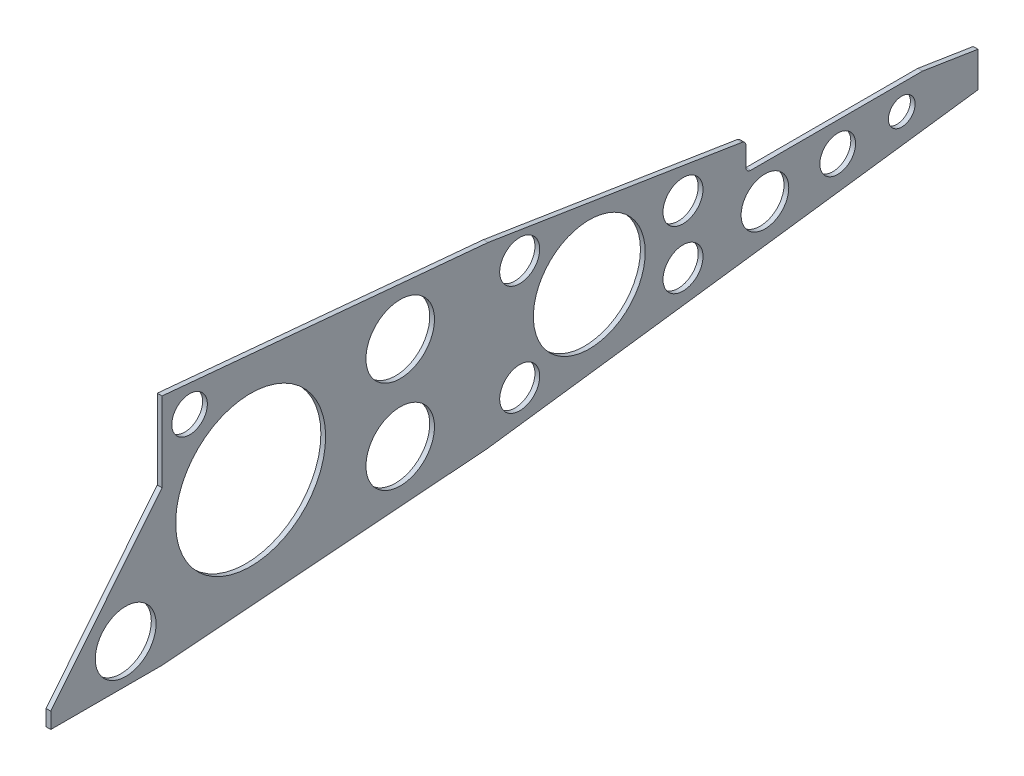
ISO-10303-21;
HEADER;
FILE_DESCRIPTION(('STEP AP214'),'2;1');
FILE_NAME('part.step','',(''),(''),'','','');
FILE_SCHEMA(('AUTOMOTIVE_DESIGN { 1 0 10303 214 1 1 1 1 }'));
ENDSEC;
DATA;
#1=APPLICATION_CONTEXT('core data for automotive mechanical design processes');
#2=APPLICATION_PROTOCOL_DEFINITION('international standard','automotive_design',2000,#1);
#3=PRODUCT_CONTEXT('',#1,'mechanical');
#4=PRODUCT('Part','Part','',(#3));
#5=PRODUCT_RELATED_PRODUCT_CATEGORY('part','',(#4));
#6=PRODUCT_DEFINITION_FORMATION('','',#4);
#7=PRODUCT_DEFINITION_CONTEXT('part definition',#1,'design');
#8=PRODUCT_DEFINITION('design','',#6,#7);
#9=PRODUCT_DEFINITION_SHAPE('','',#8);
#10=(LENGTH_UNIT() NAMED_UNIT(*) SI_UNIT(.MILLI.,.METRE.));
#11=(NAMED_UNIT(*) PLANE_ANGLE_UNIT() SI_UNIT($,.RADIAN.));
#12=(NAMED_UNIT(*) SI_UNIT($,.STERADIAN.) SOLID_ANGLE_UNIT());
#13=UNCERTAINTY_MEASURE_WITH_UNIT(LENGTH_MEASURE(1.E-05),#10,'distance_accuracy_value','');
#14=(GEOMETRIC_REPRESENTATION_CONTEXT(3) GLOBAL_UNCERTAINTY_ASSIGNED_CONTEXT((#13)) GLOBAL_UNIT_ASSIGNED_CONTEXT((#10,
#11,#12)) REPRESENTATION_CONTEXT('',''));
#15=CARTESIAN_POINT('',(0.,0.,0.));
#16=DIRECTION('',(0.,0.,1.));
#17=DIRECTION('',(1.,0.,0.));
#18=AXIS2_PLACEMENT_3D('',#15,#16,#17);
#19=CARTESIAN_POINT('',(-1.5,48.288859026105,-205.165503831176));
#20=DIRECTION('',(0.,0.987688340595138,-0.156434465040231));
#21=DIRECTION('',(0.,0.156434465040231,0.987688340595138));
#22=AXIS2_PLACEMENT_3D('',#19,#20,#21);
#23=PLANE('',#22);
#24=DIRECTION('',(-1.,0.,0.));
#25=VECTOR('',#24,1.);
#26=CARTESIAN_POINT('',(-1.5,5.,-478.480603075801));
#27=LINE('',#26,#25);
#28=CARTESIAN_POINT('',(1.5,5.,-478.4806030758));
#29=VERTEX_POINT('',#28);
#30=CARTESIAN_POINT('',(-1.5,5.,-478.4806030758));
#31=VERTEX_POINT('',#30);
#32=EDGE_CURVE('E149',#29,#31,#27,.T.);
#33=ORIENTED_EDGE('',*,*,#32,.F.);
#34=DIRECTION('',(0.,0.156434465040231,0.987688340595138));
#35=VECTOR('',#34,1.);
#36=CARTESIAN_POINT('',(1.5,48.288859026105,-205.165503831176));
#37=LINE('',#36,#35);
#38=CARTESIAN_POINT('',(1.5,-0.530689138309698,-513.4));
#39=VERTEX_POINT('',#38);
#40=EDGE_CURVE('E161',#39,#29,#37,.T.);
#41=ORIENTED_EDGE('',*,*,#40,.F.);
#42=DIRECTION('',(1.,0.,0.));
#43=VECTOR('',#42,1.);
#44=CARTESIAN_POINT('',(-1.5,-0.530689138309698,-513.4));
#45=LINE('',#44,#43);
#46=CARTESIAN_POINT('',(-1.5,-0.530689138309698,-513.4));
#47=VERTEX_POINT('',#46);
#48=EDGE_CURVE('E236',#47,#39,#45,.T.);
#49=ORIENTED_EDGE('',*,*,#48,.F.);
#50=DIRECTION('',(0.,0.156434465040231,0.987688340595138));
#51=VECTOR('',#50,1.);
#52=CARTESIAN_POINT('',(-1.5,48.288859026105,-205.165503831176));
#53=LINE('',#52,#51);
#54=EDGE_CURVE('E163',#47,#31,#53,.T.);
#55=ORIENTED_EDGE('',*,*,#54,.T.);
#56=EDGE_LOOP('',(#33,#41,#49,#55));
#57=FACE_BOUND('',#56,.T.);
#58=ADVANCED_FACE('F43',(#57),#23,.T.);
#59=CARTESIAN_POINT('',(-1.5,17.2248503298606,0.));
#60=DIRECTION('',(0.,0.627918395010104,0.778279184616892));
#61=DIRECTION('',(0.,-0.778279184616892,0.627918395010104));
#62=AXIS2_PLACEMENT_3D('',#59,#60,#61);
#63=PLANE('',#62);
#64=DIRECTION('',(1.,0.,0.));
#65=VECTOR('',#64,1.);
#66=CARTESIAN_POINT('',(-1.5,-69.5372884386745,70.));
#67=LINE('',#66,#65);
#68=CARTESIAN_POINT('',(-1.5,-69.5372884386745,70.));
#69=VERTEX_POINT('',#68);
#70=CARTESIAN_POINT('',(1.5,-69.5372884386745,70.));
#71=VERTEX_POINT('',#70);
#72=EDGE_CURVE('E224',#69,#71,#67,.T.);
#73=ORIENTED_EDGE('',*,*,#72,.T.);
#74=DIRECTION('',(0.,-0.778279184616892,0.627918395010104));
#75=VECTOR('',#74,1.);
#76=CARTESIAN_POINT('',(1.5,17.2248503298606,0.));
#77=LINE('',#76,#75);
#78=CARTESIAN_POINT('',(1.5,17.2248503298606,0.));
#79=VERTEX_POINT('',#78);
#80=EDGE_CURVE('E165',#79,#71,#77,.T.);
#81=ORIENTED_EDGE('',*,*,#80,.F.);
#82=DIRECTION('',(1.,0.,0.));
#83=VECTOR('',#82,1.);
#84=CARTESIAN_POINT('',(-1.5,17.2248503298606,0.));
#85=LINE('',#84,#83);
#86=CARTESIAN_POINT('',(-1.5,17.2248503298606,0.));
#87=VERTEX_POINT('',#86);
#88=EDGE_CURVE('E225',#87,#79,#85,.T.);
#89=ORIENTED_EDGE('',*,*,#88,.F.);
#90=DIRECTION('',(0.,-0.778279184616892,0.627918395010104));
#91=VECTOR('',#90,1.);
#92=CARTESIAN_POINT('',(-1.5,17.2248503298606,0.));
#93=LINE('',#92,#91);
#94=EDGE_CURVE('E189',#87,#69,#93,.T.);
#95=ORIENTED_EDGE('',*,*,#94,.T.);
#96=EDGE_LOOP('',(#73,#81,#89,#95));
#97=FACE_BOUND('',#96,.T.);
#98=ADVANCED_FACE('F287',(#97),#63,.T.);
#99=CARTESIAN_POINT('',(-1.5,67.2248503298606,0.));
#100=DIRECTION('',(0.,0.,1.));
#101=DIRECTION('',(0.,-1.,0.));
#102=AXIS2_PLACEMENT_3D('',#99,#100,#101);
#103=PLANE('',#102);
#104=ORIENTED_EDGE('',*,*,#88,.T.);
#105=DIRECTION('',(0.,-1.,0.));
#106=VECTOR('',#105,1.);
#107=CARTESIAN_POINT('',(1.5,67.2248503298606,0.));
#108=LINE('',#107,#106);
#109=CARTESIAN_POINT('',(1.5,67.2248503298606,0.));
#110=VERTEX_POINT('',#109);
#111=EDGE_CURVE('E181',#110,#79,#108,.T.);
#112=ORIENTED_EDGE('',*,*,#111,.F.);
#113=DIRECTION('',(1.,0.,0.));
#114=VECTOR('',#113,1.);
#115=CARTESIAN_POINT('',(-1.5,67.2248503298606,0.));
#116=LINE('',#115,#114);
#117=CARTESIAN_POINT('',(-1.5,67.2248503298606,0.));
#118=VERTEX_POINT('',#117);
#119=EDGE_CURVE('E229',#118,#110,#116,.T.);
#120=ORIENTED_EDGE('',*,*,#119,.F.);
#121=DIRECTION('',(0.,-1.,0.));
#122=VECTOR('',#121,1.);
#123=CARTESIAN_POINT('',(-1.5,67.2248503298606,0.));
#124=LINE('',#123,#122);
#125=EDGE_CURVE('E220',#118,#87,#124,.T.);
#126=ORIENTED_EDGE('',*,*,#125,.T.);
#127=EDGE_LOOP('',(#104,#112,#120,#126));
#128=FACE_BOUND('',#127,.T.);
#129=ADVANCED_FACE('F293',(#128),#103,.T.);
#130=CARTESIAN_POINT('',(-1.5,67.2248503298606,0.));
#131=DIRECTION('',(0.,0.995767728619681,-0.0919055528224595));
#132=DIRECTION('',(0.,0.0919055528224595,0.995767728619681));
#133=AXIS2_PLACEMENT_3D('',#130,#131,#132);
#134=PLANE('',#133);
#135=ORIENTED_EDGE('',*,*,#119,.T.);
#136=DIRECTION('',(0.,0.0919055528224595,0.995767728619681));
#137=VECTOR('',#136,1.);
#138=CARTESIAN_POINT('',(1.5,67.2248503298606,0.));
#139=LINE('',#138,#137);
#140=CARTESIAN_POINT('',(1.5,48.288859026105,-205.165503831176));
#141=VERTEX_POINT('',#140);
#142=EDGE_CURVE('E175',#141,#110,#139,.T.);
#143=ORIENTED_EDGE('',*,*,#142,.F.);
#144=DIRECTION('',(1.,0.,0.));
#145=VECTOR('',#144,1.);
#146=CARTESIAN_POINT('',(-1.5,48.288859026105,-205.165503831176));
#147=LINE('',#146,#145);
#148=CARTESIAN_POINT('',(-1.5,48.288859026105,-205.165503831176));
#149=VERTEX_POINT('',#148);
#150=EDGE_CURVE('E232',#149,#141,#147,.T.);
#151=ORIENTED_EDGE('',*,*,#150,.F.);
#152=DIRECTION('',(0.,0.0919055528224595,0.995767728619681));
#153=VECTOR('',#152,1.);
#154=CARTESIAN_POINT('',(-1.5,67.2248503298606,0.));
#155=LINE('',#154,#153);
#156=EDGE_CURVE('E216',#149,#118,#155,.T.);
#157=ORIENTED_EDGE('',*,*,#156,.T.);
#158=EDGE_LOOP('',(#135,#143,#151,#157));
#159=FACE_BOUND('',#158,.T.);
#160=ADVANCED_FACE('F300',(#159),#134,.T.);
#161=CARTESIAN_POINT('',(1.5,22.9942621144677,-364.869303395121));
#162=VERTEX_POINT('',#161);
#163=EDGE_CURVE('E176',#162,#141,#37,.T.);
#164=ORIENTED_EDGE('',*,*,#163,.F.);
#165=DIRECTION('',(1.,0.,0.));
#166=VECTOR('',#165,1.);
#167=CARTESIAN_POINT('',(-1.5,22.9942621144677,-364.869303395121));
#168=LINE('',#167,#166);
#169=CARTESIAN_POINT('',(-1.5,22.9942621144677,-364.869303395121));
#170=VERTEX_POINT('',#169);
#171=EDGE_CURVE('E65',#162,#170,#168,.F.);
#172=ORIENTED_EDGE('',*,*,#171,.T.);
#173=EDGE_CURVE('E213',#170,#149,#53,.T.);
#174=ORIENTED_EDGE('',*,*,#173,.T.);
#175=ORIENTED_EDGE('',*,*,#150,.T.);
#176=EDGE_LOOP('',(#164,#172,#174,#175));
#177=FACE_BOUND('',#176,.T.);
#178=ADVANCED_FACE('F289',(#177),#23,.T.);
#179=CARTESIAN_POINT('',(-1.5,-0.530689138309698,-513.4));
#180=DIRECTION('',(0.,0.,-1.));
#181=DIRECTION('',(-1.,0.,0.));
#182=AXIS2_PLACEMENT_3D('',#179,#180,#181);
#183=PLANE('',#182);
#184=ORIENTED_EDGE('',*,*,#48,.T.);
#185=DIRECTION('',(0.,1.,0.));
#186=VECTOR('',#185,1.);
#187=CARTESIAN_POINT('',(1.5,-0.530689138309698,-513.4));
#188=LINE('',#187,#186);
#189=CARTESIAN_POINT('',(1.5,-22.6501543513627,-513.4));
#190=VERTEX_POINT('',#189);
#191=EDGE_CURVE('E173',#190,#39,#188,.T.);
#192=ORIENTED_EDGE('',*,*,#191,.F.);
#193=DIRECTION('',(1.,0.,0.));
#194=VECTOR('',#193,1.);
#195=CARTESIAN_POINT('',(-1.5,-22.6501543513627,-513.4));
#196=LINE('',#195,#194);
#197=CARTESIAN_POINT('',(-1.5,-22.6501543513627,-513.4));
#198=VERTEX_POINT('',#197);
#199=EDGE_CURVE('E239',#198,#190,#196,.T.);
#200=ORIENTED_EDGE('',*,*,#199,.F.);
#201=DIRECTION('',(0.,1.,0.));
#202=VECTOR('',#201,1.);
#203=CARTESIAN_POINT('',(-1.5,-0.530689138309698,-513.4));
#204=LINE('',#203,#202);
#205=EDGE_CURVE('E209',#198,#47,#204,.T.);
#206=ORIENTED_EDGE('',*,*,#205,.T.);
#207=EDGE_LOOP('',(#184,#192,#200,#206));
#208=FACE_BOUND('',#207,.T.);
#209=ADVANCED_FACE('F299',(#208),#183,.T.);
#210=CARTESIAN_POINT('',(-1.5,-22.6501543513627,-513.4));
#211=DIRECTION('',(0.,-0.991235972394931,-0.132103168131108));
#212=DIRECTION('',(0.,0.132103168131108,-0.991235972394931));
#213=AXIS2_PLACEMENT_3D('',#210,#211,#212);
#214=PLANE('',#213);
#215=ORIENTED_EDGE('',*,*,#199,.T.);
#216=DIRECTION('',(0.,0.132103168131108,-0.991235972394931));
#217=VECTOR('',#216,1.);
#218=CARTESIAN_POINT('',(1.5,-22.6501543513627,-513.4));
#219=LINE('',#218,#217);
#220=CARTESIAN_POINT('',(1.5,-63.7176077513932,-205.250409943522));
#221=VERTEX_POINT('',#220);
#222=EDGE_CURVE('E334',#221,#190,#219,.T.);
#223=ORIENTED_EDGE('',*,*,#222,.F.);
#224=DIRECTION('',(1.,0.,0.));
#225=VECTOR('',#224,1.);
#226=CARTESIAN_POINT('',(-1.5,-63.7176077513932,-205.250409943522));
#227=LINE('',#226,#225);
#228=CARTESIAN_POINT('',(-1.5,-63.7176077513932,-205.250409943522));
#229=VERTEX_POINT('',#228);
#230=EDGE_CURVE('E242',#229,#221,#227,.T.);
#231=ORIENTED_EDGE('',*,*,#230,.F.);
#232=DIRECTION('',(0.,0.132103168131108,-0.991235972394931));
#233=VECTOR('',#232,1.);
#234=CARTESIAN_POINT('',(-1.5,-22.6501543513627,-513.4));
#235=LINE('',#234,#233);
#236=EDGE_CURVE('E205',#229,#198,#235,.T.);
#237=ORIENTED_EDGE('',*,*,#236,.T.);
#238=EDGE_LOOP('',(#215,#223,#231,#237));
#239=FACE_BOUND('',#238,.T.);
#240=ADVANCED_FACE('F305',(#239),#214,.T.);
#241=CARTESIAN_POINT('',(-1.5,-63.7176077513932,-205.250409943522));
#242=DIRECTION('',(0.,-0.997042888850237,-0.0768471066024929));
#243=DIRECTION('',(0.,0.0768471066024929,-0.997042888850237));
#244=AXIS2_PLACEMENT_3D('',#241,#242,#243);
#245=PLANE('',#244);
#246=ORIENTED_EDGE('',*,*,#230,.T.);
#247=DIRECTION('',(0.,0.0768471066024929,-0.997042888850237));
#248=VECTOR('',#247,1.);
#249=CARTESIAN_POINT('',(1.5,-63.7176077513932,-205.250409943522));
#250=LINE('',#249,#248);
#251=CARTESIAN_POINT('',(1.5,-79.5372884386745,0.));
#252=VERTEX_POINT('',#251);
#253=EDGE_CURVE('E331',#252,#221,#250,.T.);
#254=ORIENTED_EDGE('',*,*,#253,.F.);
#255=DIRECTION('',(1.,0.,0.));
#256=VECTOR('',#255,1.);
#257=CARTESIAN_POINT('',(-1.5,-79.5372884386745,0.));
#258=LINE('',#257,#256);
#259=CARTESIAN_POINT('',(-1.5,-79.5372884386745,0.));
#260=VERTEX_POINT('',#259);
#261=EDGE_CURVE('E245',#260,#252,#258,.T.);
#262=ORIENTED_EDGE('',*,*,#261,.F.);
#263=DIRECTION('',(0.,0.0768471066024929,-0.997042888850237));
#264=VECTOR('',#263,1.);
#265=CARTESIAN_POINT('',(-1.5,-63.7176077513932,-205.250409943522));
#266=LINE('',#265,#264);
#267=EDGE_CURVE('E201',#260,#229,#266,.T.);
#268=ORIENTED_EDGE('',*,*,#267,.T.);
#269=EDGE_LOOP('',(#246,#254,#262,#268));
#270=FACE_BOUND('',#269,.T.);
#271=ADVANCED_FACE('F344',(#270),#245,.T.);
#272=CARTESIAN_POINT('',(-1.5,-79.5372884386745,70.));
#273=DIRECTION('',(0.,-1.,0.));
#274=DIRECTION('',(0.,0.,-1.));
#275=AXIS2_PLACEMENT_3D('',#272,#273,#274);
#276=PLANE('',#275);
#277=ORIENTED_EDGE('',*,*,#261,.T.);
#278=DIRECTION('',(0.,0.,-1.));
#279=VECTOR('',#278,1.);
#280=CARTESIAN_POINT('',(1.5,-79.5372884386745,70.));
#281=LINE('',#280,#279);
#282=CARTESIAN_POINT('',(1.5,-79.5372884386745,70.));
#283=VERTEX_POINT('',#282);
#284=EDGE_CURVE('E327',#283,#252,#281,.T.);
#285=ORIENTED_EDGE('',*,*,#284,.F.);
#286=DIRECTION('',(1.,0.,0.));
#287=VECTOR('',#286,1.);
#288=CARTESIAN_POINT('',(-1.5,-79.5372884386745,70.));
#289=LINE('',#288,#287);
#290=CARTESIAN_POINT('',(-1.5,-79.5372884386745,70.));
#291=VERTEX_POINT('',#290);
#292=EDGE_CURVE('E248',#291,#283,#289,.T.);
#293=ORIENTED_EDGE('',*,*,#292,.F.);
#294=DIRECTION('',(0.,0.,-1.));
#295=VECTOR('',#294,1.);
#296=CARTESIAN_POINT('',(-1.5,-79.5372884386745,70.));
#297=LINE('',#296,#295);
#298=EDGE_CURVE('E197',#291,#260,#297,.T.);
#299=ORIENTED_EDGE('',*,*,#298,.T.);
#300=EDGE_LOOP('',(#277,#285,#293,#299));
#301=FACE_BOUND('',#300,.T.);
#302=ADVANCED_FACE('F348',(#301),#276,.T.);
#303=CARTESIAN_POINT('',(-1.5,-69.5372884386745,70.));
#304=DIRECTION('',(0.,0.,1.));
#305=DIRECTION('',(1.,0.,0.));
#306=AXIS2_PLACEMENT_3D('',#303,#304,#305);
#307=PLANE('',#306);
#308=ORIENTED_EDGE('',*,*,#292,.T.);
#309=DIRECTION('',(0.,-1.,0.));
#310=VECTOR('',#309,1.);
#311=CARTESIAN_POINT('',(1.5,-69.5372884386745,70.));
#312=LINE('',#311,#310);
#313=EDGE_CURVE('E323',#71,#283,#312,.T.);
#314=ORIENTED_EDGE('',*,*,#313,.F.);
#315=ORIENTED_EDGE('',*,*,#72,.F.);
#316=DIRECTION('',(0.,-1.,0.));
#317=VECTOR('',#316,1.);
#318=CARTESIAN_POINT('',(-1.5,-69.5372884386745,70.));
#319=LINE('',#318,#317);
#320=EDGE_CURVE('E193',#69,#291,#319,.T.);
#321=ORIENTED_EDGE('',*,*,#320,.T.);
#322=EDGE_LOOP('',(#308,#314,#315,#321));
#323=FACE_BOUND('',#322,.T.);
#324=ADVANCED_FACE('F352',(#323),#307,.T.);
#325=CARTESIAN_POINT('',(-1.5,0.,0.));
#326=DIRECTION('',(1.,0.,0.));
#327=DIRECTION('',(0.,0.,-1.));
#328=AXIS2_PLACEMENT_3D('',#325,#326,#327);
#329=PLANE('',#328);
#330=CARTESIAN_POINT('',(-1.5,-55.0693391314664,22.8656003852971));
#331=DIRECTION('',(1.,0.,0.));
#332=DIRECTION('',(0.,0.,-1.));
#333=AXIS2_PLACEMENT_3D('',#330,#331,#332);
#334=CIRCLE('',#333,19.1193877962969);
#335=CARTESIAN_POINT('',(-1.5,-55.0693391314664,3.74621258900012));
#336=VERTEX_POINT('',#335);
#337=EDGE_CURVE('E157',#336,#336,#334,.T.);
#338=ORIENTED_EDGE('',*,*,#337,.T.);
#339=EDGE_LOOP('',(#338));
#340=FACE_BOUND('',#339,.T.);
#341=CARTESIAN_POINT('',(-1.5,-10.5286521763011,-465.431260698025));
#342=DIRECTION('',(1.,0.,0.));
#343=DIRECTION('',(0.,0.,-1.));
#344=AXIS2_PLACEMENT_3D('',#341,#342,#343);
#345=CIRCLE('',#344,8.41496244987392);
#346=CARTESIAN_POINT('',(-1.5,-10.5286521763011,-473.846223147899));
#347=VERTEX_POINT('',#346);
#348=EDGE_CURVE('E432',#347,#347,#345,.T.);
#349=ORIENTED_EDGE('',*,*,#348,.T.);
#350=EDGE_LOOP('',(#349));
#351=FACE_BOUND('',#350,.T.);
#352=CARTESIAN_POINT('',(-1.5,-13.3760775838555,-425.129239544948));
#353=DIRECTION('',(1.,0.,0.));
#354=DIRECTION('',(0.,0.,-1.));
#355=AXIS2_PLACEMENT_3D('',#352,#353,#354);
#356=CIRCLE('',#355,11.2391749923662);
#357=CARTESIAN_POINT('',(-1.5,-13.3760775838555,-436.368414537314));
#358=VERTEX_POINT('',#357);
#359=EDGE_CURVE('E435',#358,#358,#356,.T.);
#360=ORIENTED_EDGE('',*,*,#359,.T.);
#361=EDGE_LOOP('',(#360));
#362=FACE_BOUND('',#361,.T.);
#363=CARTESIAN_POINT('',(-1.5,9.70145914409179,-327.790100623759));
#364=DIRECTION('',(1.,0.,0.));
#365=DIRECTION('',(0.,0.,-1.));
#366=AXIS2_PLACEMENT_3D('',#363,#364,#365);
#367=CIRCLE('',#366,12.5869787378772);
#368=CARTESIAN_POINT('',(-1.5,9.70145914409179,-340.377079361636));
#369=VERTEX_POINT('',#368);
#370=EDGE_CURVE('E440',#369,#369,#367,.T.);
#371=ORIENTED_EDGE('',*,*,#370,.T.);
#372=EDGE_LOOP('',(#371));
#373=FACE_BOUND('',#372,.T.);
#374=CARTESIAN_POINT('',(-1.5,-26.9275440186377,-327.790100623759));
#375=DIRECTION('',(1.,0.,0.));
#376=DIRECTION('',(0.,0.,-1.));
#377=AXIS2_PLACEMENT_3D('',#374,#375,#376);
#378=CIRCLE('',#377,12.5869787378772);
#379=CARTESIAN_POINT('',(-1.5,-26.9275440186377,-340.377079361636));
#380=VERTEX_POINT('',#379);
#381=EDGE_CURVE('E446',#380,#380,#378,.T.);
#382=ORIENTED_EDGE('',*,*,#381,.T.);
#383=EDGE_LOOP('',(#382));
#384=FACE_BOUND('',#383,.T.);
#385=CARTESIAN_POINT('',(-1.5,23.2938907164738,-149.867646424436));
#386=DIRECTION('',(1.,0.,0.));
#387=DIRECTION('',(0.,0.,-1.));
#388=AXIS2_PLACEMENT_3D('',#385,#386,#387);
#389=CIRCLE('',#388,21.5573807133977);
#390=CARTESIAN_POINT('',(-1.5,23.2938907164738,-171.425027137834));
#391=VERTEX_POINT('',#390);
#392=EDGE_CURVE('E450',#391,#391,#389,.T.);
#393=ORIENTED_EDGE('',*,*,#392,.T.);
#394=EDGE_LOOP('',(#393));
#395=FACE_BOUND('',#394,.T.);
#396=CARTESIAN_POINT('',(-1.5,-6.37956663466746,-268.826339434975));
#397=DIRECTION('',(1.,0.,0.));
#398=DIRECTION('',(0.,0.,-1.));
#399=AXIS2_PLACEMENT_3D('',#396,#397,#398);
#400=CIRCLE('',#399,35.1869918395497);
#401=CARTESIAN_POINT('',(-1.5,-6.37956663466746,-304.013331274525));
#402=VERTEX_POINT('',#401);
#403=EDGE_CURVE('E454',#402,#402,#400,.T.);
#404=ORIENTED_EDGE('',*,*,#403,.T.);
#405=EDGE_LOOP('',(#404));
#406=FACE_BOUND('',#405,.T.);
#407=CARTESIAN_POINT('',(-1.5,-16.4425357150679,-379.35140030042));
#408=DIRECTION('',(1.,0.,0.));
#409=DIRECTION('',(0.,0.,-1.));
#410=AXIS2_PLACEMENT_3D('',#407,#408,#409);
#411=CIRCLE('',#410,14.9841437284449);
#412=CARTESIAN_POINT('',(-1.5,-16.4425357150679,-394.335544028865));
#413=VERTEX_POINT('',#412);
#414=EDGE_CURVE('E458',#413,#413,#411,.T.);
#415=ORIENTED_EDGE('',*,*,#414,.T.);
#416=EDGE_LOOP('',(#415));
#417=FACE_BOUND('',#416,.T.);
#418=CARTESIAN_POINT('',(-1.5,-6.37956663466746,-55.7527478664149));
#419=DIRECTION('',(1.,0.,0.));
#420=DIRECTION('',(0.,0.,-1.));
#421=AXIS2_PLACEMENT_3D('',#418,#419,#420);
#422=CIRCLE('',#421,47.1913934733686);
#423=CARTESIAN_POINT('',(-1.5,-6.37956663466746,-102.944141339784));
#424=VERTEX_POINT('',#423);
#425=EDGE_CURVE('E462',#424,#424,#422,.T.);
#426=ORIENTED_EDGE('',*,*,#425,.T.);
#427=EDGE_LOOP('',(#426));
#428=FACE_BOUND('',#427,.T.);
#429=CARTESIAN_POINT('',(-1.5,-40.7750939947914,-225.050213703908));
#430=DIRECTION('',(1.,0.,0.));
#431=DIRECTION('',(0.,0.,-1.));
#432=AXIS2_PLACEMENT_3D('',#429,#430,#431);
#433=CIRCLE('',#432,12.5869787378772);
#434=CARTESIAN_POINT('',(-1.5,-40.7750939947914,-237.637192441785));
#435=VERTEX_POINT('',#434);
#436=EDGE_CURVE('E466',#435,#435,#433,.T.);
#437=ORIENTED_EDGE('',*,*,#436,.T.);
#438=EDGE_LOOP('',(#437));
#439=FACE_BOUND('',#438,.T.);
#440=CARTESIAN_POINT('',(-1.5,48.5639381094267,-17.3369640616011));
#441=DIRECTION('',(1.,0.,0.));
#442=DIRECTION('',(0.,0.,-1.));
#443=AXIS2_PLACEMENT_3D('',#440,#441,#442);
#444=CIRCLE('',#443,11.1896033535979);
#445=CARTESIAN_POINT('',(-1.5,48.5639381094267,-28.526567415199));
#446=VERTEX_POINT('',#445);
#447=EDGE_CURVE('E470',#446,#446,#444,.T.);
#448=ORIENTED_EDGE('',*,*,#447,.T.);
#449=EDGE_LOOP('',(#448));
#450=FACE_BOUND('',#449,.T.);
#451=CARTESIAN_POINT('',(-1.5,28.4626558859776,-225.050213703908));
#452=DIRECTION('',(1.,0.,0.));
#453=DIRECTION('',(0.,0.,-1.));
#454=AXIS2_PLACEMENT_3D('',#451,#452,#453);
#455=CIRCLE('',#454,12.5869787378772);
#456=CARTESIAN_POINT('',(-1.5,28.4626558859776,-237.637192441785));
#457=VERTEX_POINT('',#456);
#458=EDGE_CURVE('E474',#457,#457,#455,.T.);
#459=ORIENTED_EDGE('',*,*,#458,.T.);
#460=EDGE_LOOP('',(#459));
#461=FACE_BOUND('',#460,.T.);
#462=CARTESIAN_POINT('',(-1.5,-35.1806808461792,-149.867646424436));
#463=DIRECTION('',(1.,0.,0.));
#464=DIRECTION('',(0.,0.,-1.));
#465=AXIS2_PLACEMENT_3D('',#462,#463,#464);
#466=CIRCLE('',#465,21.5573807133977);
#467=CARTESIAN_POINT('',(-1.5,-35.1806808461792,-171.425027137834));
#468=VERTEX_POINT('',#467);
#469=EDGE_CURVE('E478',#468,#468,#466,.T.);
#470=ORIENTED_EDGE('',*,*,#469,.T.);
#471=EDGE_LOOP('',(#470));
#472=FACE_BOUND('',#471,.T.);
#473=ORIENTED_EDGE('',*,*,#173,.F.);
#474=CARTESIAN_POINT('',(-1.5,20.0311970926823,-364.4));
#475=DIRECTION('',(1.,0.,0.));
#476=DIRECTION('',(0.,0.,-1.));
#477=AXIS2_PLACEMENT_3D('',#474,#475,#476);
#478=CIRCLE('',#477,3.);
#479=CARTESIAN_POINT('',(-1.5,20.0311970926823,-367.4));
#480=VERTEX_POINT('',#479);
#481=EDGE_CURVE('E268',#170,#480,#478,.F.);
#482=ORIENTED_EDGE('',*,*,#481,.T.);
#483=DIRECTION('',(0.,-1.,0.));
#484=VECTOR('',#483,1.);
#485=CARTESIAN_POINT('',(-1.5,30.,-367.4));
#486=LINE('',#485,#484);
#487=CARTESIAN_POINT('',(-1.5,7.99999999999999,-367.4));
#488=VERTEX_POINT('',#487);
#489=EDGE_CURVE('E156',#480,#488,#486,.T.);
#490=ORIENTED_EDGE('',*,*,#489,.T.);
#491=CARTESIAN_POINT('',(-1.5,7.99999999999998,-370.4));
#492=DIRECTION('',(1.,0.,0.));
#493=DIRECTION('',(0.,0.,-1.));
#494=AXIS2_PLACEMENT_3D('',#491,#492,#493);
#495=CIRCLE('',#494,3.);
#496=CARTESIAN_POINT('',(-1.5,4.99999999999998,-370.4));
#497=VERTEX_POINT('',#496);
#498=EDGE_CURVE('E11',#488,#497,#495,.T.);
#499=ORIENTED_EDGE('',*,*,#498,.T.);
#500=DIRECTION('',(0.,0.,-1.));
#501=VECTOR('',#500,1.);
#502=CARTESIAN_POINT('',(-1.5,5.,-519.4));
#503=LINE('',#502,#501);
#504=EDGE_CURVE('E166',#497,#31,#503,.T.);
#505=ORIENTED_EDGE('',*,*,#504,.T.);
#506=ORIENTED_EDGE('',*,*,#54,.F.);
#507=ORIENTED_EDGE('',*,*,#205,.F.);
#508=ORIENTED_EDGE('',*,*,#236,.F.);
#509=ORIENTED_EDGE('',*,*,#267,.F.);
#510=ORIENTED_EDGE('',*,*,#298,.F.);
#511=ORIENTED_EDGE('',*,*,#320,.F.);
#512=ORIENTED_EDGE('',*,*,#94,.F.);
#513=ORIENTED_EDGE('',*,*,#125,.F.);
#514=ORIENTED_EDGE('',*,*,#156,.F.);
#515=EDGE_LOOP('',(#473,#482,#490,#499,#505,#506,#507,#508,#509,#510,#511,#512,#513,#514));
#516=FACE_BOUND('',#515,.T.);
#517=ADVANCED_FACE('F311',(#340,#351,#362,#373,#384,#395,#406,#417,#428,#439,#450,#461,#472,
#516),#329,.F.);
#518=CARTESIAN_POINT('',(1.5,0.,0.));
#519=DIRECTION('',(1.,0.,0.));
#520=DIRECTION('',(0.,0.,-1.));
#521=AXIS2_PLACEMENT_3D('',#518,#519,#520);
#522=PLANE('',#521);
#523=CARTESIAN_POINT('',(1.5,-55.0693391314664,22.8656003852971));
#524=DIRECTION('',(1.,0.,0.));
#525=DIRECTION('',(0.,0.,-1.));
#526=AXIS2_PLACEMENT_3D('',#523,#524,#525);
#527=CIRCLE('',#526,19.1193877962969);
#528=CARTESIAN_POINT('',(1.5,-55.0693391314664,3.74621258900012));
#529=VERTEX_POINT('',#528);
#530=EDGE_CURVE('E428',#529,#529,#527,.T.);
#531=ORIENTED_EDGE('',*,*,#530,.F.);
#532=EDGE_LOOP('',(#531));
#533=FACE_BOUND('',#532,.T.);
#534=CARTESIAN_POINT('',(1.5,-10.5286521763011,-465.431260698025));
#535=DIRECTION('',(1.,0.,0.));
#536=DIRECTION('',(0.,0.,-1.));
#537=AXIS2_PLACEMENT_3D('',#534,#535,#536);
#538=CIRCLE('',#537,8.41496244987392);
#539=CARTESIAN_POINT('',(1.5,-10.5286521763011,-473.846223147899));
#540=VERTEX_POINT('',#539);
#541=EDGE_CURVE('E515',#540,#540,#538,.T.);
#542=ORIENTED_EDGE('',*,*,#541,.F.);
#543=EDGE_LOOP('',(#542));
#544=FACE_BOUND('',#543,.T.);
#545=CARTESIAN_POINT('',(1.5,-13.3760775838555,-425.129239544948));
#546=DIRECTION('',(1.,0.,0.));
#547=DIRECTION('',(0.,0.,-1.));
#548=AXIS2_PLACEMENT_3D('',#545,#546,#547);
#549=CIRCLE('',#548,11.2391749923662);
#550=CARTESIAN_POINT('',(1.5,-13.3760775838555,-436.368414537314));
#551=VERTEX_POINT('',#550);
#552=EDGE_CURVE('E519',#551,#551,#549,.T.);
#553=ORIENTED_EDGE('',*,*,#552,.F.);
#554=EDGE_LOOP('',(#553));
#555=FACE_BOUND('',#554,.T.);
#556=CARTESIAN_POINT('',(1.5,9.70145914409179,-327.790100623759));
#557=DIRECTION('',(1.,0.,0.));
#558=DIRECTION('',(0.,0.,-1.));
#559=AXIS2_PLACEMENT_3D('',#556,#557,#558);
#560=CIRCLE('',#559,12.5869787378772);
#561=CARTESIAN_POINT('',(1.5,9.70145914409179,-340.377079361636));
#562=VERTEX_POINT('',#561);
#563=EDGE_CURVE('E523',#562,#562,#560,.T.);
#564=ORIENTED_EDGE('',*,*,#563,.F.);
#565=EDGE_LOOP('',(#564));
#566=FACE_BOUND('',#565,.T.);
#567=CARTESIAN_POINT('',(1.5,-26.9275440186377,-327.790100623759));
#568=DIRECTION('',(1.,0.,0.));
#569=DIRECTION('',(0.,0.,-1.));
#570=AXIS2_PLACEMENT_3D('',#567,#568,#569);
#571=CIRCLE('',#570,12.5869787378772);
#572=CARTESIAN_POINT('',(1.5,-26.9275440186377,-340.377079361636));
#573=VERTEX_POINT('',#572);
#574=EDGE_CURVE('E511',#573,#573,#571,.T.);
#575=ORIENTED_EDGE('',*,*,#574,.F.);
#576=EDGE_LOOP('',(#575));
#577=FACE_BOUND('',#576,.T.);
#578=CARTESIAN_POINT('',(1.5,23.2938907164738,-149.867646424436));
#579=DIRECTION('',(1.,0.,0.));
#580=DIRECTION('',(0.,0.,-1.));
#581=AXIS2_PLACEMENT_3D('',#578,#579,#580);
#582=CIRCLE('',#581,21.5573807133977);
#583=CARTESIAN_POINT('',(1.5,23.2938907164738,-171.425027137834));
#584=VERTEX_POINT('',#583);
#585=EDGE_CURVE('E491',#584,#584,#582,.T.);
#586=ORIENTED_EDGE('',*,*,#585,.F.);
#587=EDGE_LOOP('',(#586));
#588=FACE_BOUND('',#587,.T.);
#589=CARTESIAN_POINT('',(1.5,-6.37956663466746,-268.826339434975));
#590=DIRECTION('',(1.,0.,0.));
#591=DIRECTION('',(0.,0.,-1.));
#592=AXIS2_PLACEMENT_3D('',#589,#590,#591);
#593=CIRCLE('',#592,35.1869918395497);
#594=CARTESIAN_POINT('',(1.5,-6.37956663466746,-304.013331274525));
#595=VERTEX_POINT('',#594);
#596=EDGE_CURVE('E487',#595,#595,#593,.T.);
#597=ORIENTED_EDGE('',*,*,#596,.F.);
#598=EDGE_LOOP('',(#597));
#599=FACE_BOUND('',#598,.T.);
#600=CARTESIAN_POINT('',(1.5,-16.4425357150679,-379.35140030042));
#601=DIRECTION('',(1.,0.,0.));
#602=DIRECTION('',(0.,0.,-1.));
#603=AXIS2_PLACEMENT_3D('',#600,#601,#602);
#604=CIRCLE('',#603,14.9841437284449);
#605=CARTESIAN_POINT('',(1.5,-16.4425357150679,-394.335544028865));
#606=VERTEX_POINT('',#605);
#607=EDGE_CURVE('E482',#606,#606,#604,.T.);
#608=ORIENTED_EDGE('',*,*,#607,.F.);
#609=EDGE_LOOP('',(#608));
#610=FACE_BOUND('',#609,.T.);
#611=CARTESIAN_POINT('',(1.5,-6.37956663466746,-55.7527478664149));
#612=DIRECTION('',(1.,0.,0.));
#613=DIRECTION('',(0.,0.,-1.));
#614=AXIS2_PLACEMENT_3D('',#611,#612,#613);
#615=CIRCLE('',#614,47.1913934733686);
#616=CARTESIAN_POINT('',(1.5,-6.37956663466746,-102.944141339784));
#617=VERTEX_POINT('',#616);
#618=EDGE_CURVE('E486',#617,#617,#615,.T.);
#619=ORIENTED_EDGE('',*,*,#618,.F.);
#620=EDGE_LOOP('',(#619));
#621=FACE_BOUND('',#620,.T.);
#622=CARTESIAN_POINT('',(1.5,-40.7750939947914,-225.050213703908));
#623=DIRECTION('',(1.,0.,0.));
#624=DIRECTION('',(0.,0.,-1.));
#625=AXIS2_PLACEMENT_3D('',#622,#623,#624);
#626=CIRCLE('',#625,12.5869787378772);
#627=CARTESIAN_POINT('',(1.5,-40.7750939947914,-237.637192441785));
#628=VERTEX_POINT('',#627);
#629=EDGE_CURVE('E507',#628,#628,#626,.T.);
#630=ORIENTED_EDGE('',*,*,#629,.F.);
#631=EDGE_LOOP('',(#630));
#632=FACE_BOUND('',#631,.T.);
#633=CARTESIAN_POINT('',(1.5,48.5639381094267,-17.3369640616011));
#634=DIRECTION('',(1.,0.,0.));
#635=DIRECTION('',(0.,0.,-1.));
#636=AXIS2_PLACEMENT_3D('',#633,#634,#635);
#637=CIRCLE('',#636,11.1896033535979);
#638=CARTESIAN_POINT('',(1.5,48.5639381094267,-28.526567415199));
#639=VERTEX_POINT('',#638);
#640=EDGE_CURVE('E503',#639,#639,#637,.T.);
#641=ORIENTED_EDGE('',*,*,#640,.F.);
#642=EDGE_LOOP('',(#641));
#643=FACE_BOUND('',#642,.T.);
#644=CARTESIAN_POINT('',(1.5,28.4626558859776,-225.050213703908));
#645=DIRECTION('',(1.,0.,0.));
#646=DIRECTION('',(0.,0.,-1.));
#647=AXIS2_PLACEMENT_3D('',#644,#645,#646);
#648=CIRCLE('',#647,12.5869787378772);
#649=CARTESIAN_POINT('',(1.5,28.4626558859776,-237.637192441785));
#650=VERTEX_POINT('',#649);
#651=EDGE_CURVE('E499',#650,#650,#648,.T.);
#652=ORIENTED_EDGE('',*,*,#651,.F.);
#653=EDGE_LOOP('',(#652));
#654=FACE_BOUND('',#653,.T.);
#655=CARTESIAN_POINT('',(1.5,-35.1806808461792,-149.867646424436));
#656=DIRECTION('',(1.,0.,0.));
#657=DIRECTION('',(0.,0.,-1.));
#658=AXIS2_PLACEMENT_3D('',#655,#656,#657);
#659=CIRCLE('',#658,21.5573807133977);
#660=CARTESIAN_POINT('',(1.5,-35.1806808461792,-171.425027137834));
#661=VERTEX_POINT('',#660);
#662=EDGE_CURVE('E495',#661,#661,#659,.T.);
#663=ORIENTED_EDGE('',*,*,#662,.F.);
#664=EDGE_LOOP('',(#663));
#665=FACE_BOUND('',#664,.T.);
#666=DIRECTION('',(0.,-1.,0.));
#667=VECTOR('',#666,1.);
#668=CARTESIAN_POINT('',(1.5,0.,-367.4));
#669=LINE('',#668,#667);
#670=CARTESIAN_POINT('',(1.5,20.0311970926823,-367.4));
#671=VERTEX_POINT('',#670);
#672=CARTESIAN_POINT('',(1.5,7.99999999999998,-367.4));
#673=VERTEX_POINT('',#672);
#674=EDGE_CURVE('E228',#671,#673,#669,.T.);
#675=ORIENTED_EDGE('',*,*,#674,.F.);
#676=CARTESIAN_POINT('',(1.5,20.0311970926823,-364.4));
#677=DIRECTION('',(1.,0.,0.));
#678=DIRECTION('',(0.,0.,-1.));
#679=AXIS2_PLACEMENT_3D('',#676,#677,#678);
#680=CIRCLE('',#679,3.);
#681=EDGE_CURVE('E263',#671,#162,#680,.T.);
#682=ORIENTED_EDGE('',*,*,#681,.T.);
#683=ORIENTED_EDGE('',*,*,#163,.T.);
#684=ORIENTED_EDGE('',*,*,#142,.T.);
#685=ORIENTED_EDGE('',*,*,#111,.T.);
#686=ORIENTED_EDGE('',*,*,#80,.T.);
#687=ORIENTED_EDGE('',*,*,#313,.T.);
#688=ORIENTED_EDGE('',*,*,#284,.T.);
#689=ORIENTED_EDGE('',*,*,#253,.T.);
#690=ORIENTED_EDGE('',*,*,#222,.T.);
#691=ORIENTED_EDGE('',*,*,#191,.T.);
#692=ORIENTED_EDGE('',*,*,#40,.T.);
#693=DIRECTION('',(0.,0.,-1.));
#694=VECTOR('',#693,1.);
#695=CARTESIAN_POINT('',(1.5,5.,-519.4));
#696=LINE('',#695,#694);
#697=CARTESIAN_POINT('',(1.5,4.99999999999998,-370.4));
#698=VERTEX_POINT('',#697);
#699=EDGE_CURVE('E146',#698,#29,#696,.T.);
#700=ORIENTED_EDGE('',*,*,#699,.F.);
#701=CARTESIAN_POINT('',(1.5,7.99999999999998,-370.4));
#702=DIRECTION('',(1.,0.,0.));
#703=DIRECTION('',(0.,0.,-1.));
#704=AXIS2_PLACEMENT_3D('',#701,#702,#703);
#705=CIRCLE('',#704,3.);
#706=EDGE_CURVE('E52',#698,#673,#705,.F.);
#707=ORIENTED_EDGE('',*,*,#706,.T.);
#708=EDGE_LOOP('',(#675,#682,#683,#684,#685,#686,#687,#688,#689,#690,#691,#692,#700,#707));
#709=FACE_BOUND('',#708,.T.);
#710=ADVANCED_FACE('F170',(#533,#544,#555,#566,#577,#588,#599,#610,#621,#632,#643,#654,#665,
#709),#522,.T.);
#711=CARTESIAN_POINT('',(-1.5,5.,-519.4));
#712=DIRECTION('',(0.,-1.,0.));
#713=DIRECTION('',(0.,0.,-1.));
#714=AXIS2_PLACEMENT_3D('',#711,#712,#713);
#715=PLANE('',#714);
#716=ORIENTED_EDGE('',*,*,#504,.F.);
#717=DIRECTION('',(1.,0.,0.));
#718=VECTOR('',#717,1.);
#719=CARTESIAN_POINT('',(1.5,4.99999999999998,-370.4));
#720=LINE('',#719,#718);
#721=EDGE_CURVE('E152',#497,#698,#720,.T.);
#722=ORIENTED_EDGE('',*,*,#721,.T.);
#723=ORIENTED_EDGE('',*,*,#699,.T.);
#724=ORIENTED_EDGE('',*,*,#32,.T.);
#725=EDGE_LOOP('',(#716,#722,#723,#724));
#726=FACE_BOUND('',#725,.T.);
#727=ADVANCED_FACE('F148',(#726),#715,.F.);
#728=CARTESIAN_POINT('',(-1.5,30.,-367.4));
#729=DIRECTION('',(0.,0.,1.));
#730=DIRECTION('',(1.,0.,0.));
#731=AXIS2_PLACEMENT_3D('',#728,#729,#730);
#732=PLANE('',#731);
#733=ORIENTED_EDGE('',*,*,#489,.F.);
#734=DIRECTION('',(1.,0.,0.));
#735=VECTOR('',#734,1.);
#736=CARTESIAN_POINT('',(1.5,20.0311970926823,-367.4));
#737=LINE('',#736,#735);
#738=EDGE_CURVE('E259',#480,#671,#737,.T.);
#739=ORIENTED_EDGE('',*,*,#738,.T.);
#740=ORIENTED_EDGE('',*,*,#674,.T.);
#741=DIRECTION('',(1.,0.,0.));
#742=VECTOR('',#741,1.);
#743=CARTESIAN_POINT('',(-1.5,7.99999999999998,-367.4));
#744=LINE('',#743,#742);
#745=EDGE_CURVE('E256',#673,#488,#744,.F.);
#746=ORIENTED_EDGE('',*,*,#745,.T.);
#747=EDGE_LOOP('',(#733,#739,#740,#746));
#748=FACE_BOUND('',#747,.T.);
#749=ADVANCED_FACE('F277',(#748),#732,.F.);
#750=CARTESIAN_POINT('',(-8.5,-35.1806808461792,-149.867646424436));
#751=DIRECTION('',(1.,0.,0.));
#752=DIRECTION('',(0.,0.,-1.));
#753=AXIS2_PLACEMENT_3D('',#750,#751,#752);
#754=CYLINDRICAL_SURFACE('',#753,21.5573807133977);
#755=ORIENTED_EDGE('',*,*,#662,.T.);
#756=EDGE_LOOP('',(#755));
#757=FACE_BOUND('',#756,.T.);
#758=ORIENTED_EDGE('',*,*,#469,.F.);
#759=EDGE_LOOP('',(#758));
#760=FACE_BOUND('',#759,.T.);
#761=ADVANCED_FACE('F371',(#757,#760),#754,.F.);
#762=CARTESIAN_POINT('',(-8.5,28.4626558859776,-225.050213703908));
#763=DIRECTION('',(1.,0.,0.));
#764=DIRECTION('',(0.,0.,-1.));
#765=AXIS2_PLACEMENT_3D('',#762,#763,#764);
#766=CYLINDRICAL_SURFACE('',#765,12.5869787378772);
#767=ORIENTED_EDGE('',*,*,#651,.T.);
#768=EDGE_LOOP('',(#767));
#769=FACE_BOUND('',#768,.T.);
#770=ORIENTED_EDGE('',*,*,#458,.F.);
#771=EDGE_LOOP('',(#770));
#772=FACE_BOUND('',#771,.T.);
#773=ADVANCED_FACE('F392',(#769,#772),#766,.F.);
#774=CARTESIAN_POINT('',(-8.5,48.5639381094267,-17.3369640616011));
#775=DIRECTION('',(1.,0.,0.));
#776=DIRECTION('',(0.,0.,-1.));
#777=AXIS2_PLACEMENT_3D('',#774,#775,#776);
#778=CYLINDRICAL_SURFACE('',#777,11.1896033535979);
#779=ORIENTED_EDGE('',*,*,#640,.T.);
#780=EDGE_LOOP('',(#779));
#781=FACE_BOUND('',#780,.T.);
#782=ORIENTED_EDGE('',*,*,#447,.F.);
#783=EDGE_LOOP('',(#782));
#784=FACE_BOUND('',#783,.T.);
#785=ADVANCED_FACE('F395',(#781,#784),#778,.F.);
#786=CARTESIAN_POINT('',(-8.5,-40.7750939947914,-225.050213703908));
#787=DIRECTION('',(1.,0.,0.));
#788=DIRECTION('',(0.,0.,-1.));
#789=AXIS2_PLACEMENT_3D('',#786,#787,#788);
#790=CYLINDRICAL_SURFACE('',#789,12.5869787378772);
#791=ORIENTED_EDGE('',*,*,#629,.T.);
#792=EDGE_LOOP('',(#791));
#793=FACE_BOUND('',#792,.T.);
#794=ORIENTED_EDGE('',*,*,#436,.F.);
#795=EDGE_LOOP('',(#794));
#796=FACE_BOUND('',#795,.T.);
#797=ADVANCED_FACE('F382',(#793,#796),#790,.F.);
#798=CARTESIAN_POINT('',(-8.5,-6.37956663466746,-55.7527478664149));
#799=DIRECTION('',(1.,0.,0.));
#800=DIRECTION('',(0.,0.,-1.));
#801=AXIS2_PLACEMENT_3D('',#798,#799,#800);
#802=CYLINDRICAL_SURFACE('',#801,47.1913934733686);
#803=ORIENTED_EDGE('',*,*,#618,.T.);
#804=EDGE_LOOP('',(#803));
#805=FACE_BOUND('',#804,.T.);
#806=ORIENTED_EDGE('',*,*,#425,.F.);
#807=EDGE_LOOP('',(#806));
#808=FACE_BOUND('',#807,.T.);
#809=ADVANCED_FACE('F378',(#805,#808),#802,.F.);
#810=CARTESIAN_POINT('',(-8.5,-16.4425357150679,-379.35140030042));
#811=DIRECTION('',(1.,0.,0.));
#812=DIRECTION('',(0.,0.,-1.));
#813=AXIS2_PLACEMENT_3D('',#810,#811,#812);
#814=CYLINDRICAL_SURFACE('',#813,14.9841437284449);
#815=ORIENTED_EDGE('',*,*,#607,.T.);
#816=EDGE_LOOP('',(#815));
#817=FACE_BOUND('',#816,.T.);
#818=ORIENTED_EDGE('',*,*,#414,.F.);
#819=EDGE_LOOP('',(#818));
#820=FACE_BOUND('',#819,.T.);
#821=ADVANCED_FACE('F374',(#817,#820),#814,.F.);
#822=CARTESIAN_POINT('',(-8.5,-6.37956663466746,-268.826339434975));
#823=DIRECTION('',(1.,0.,0.));
#824=DIRECTION('',(0.,0.,-1.));
#825=AXIS2_PLACEMENT_3D('',#822,#823,#824);
#826=CYLINDRICAL_SURFACE('',#825,35.1869918395497);
#827=ORIENTED_EDGE('',*,*,#596,.T.);
#828=EDGE_LOOP('',(#827));
#829=FACE_BOUND('',#828,.T.);
#830=ORIENTED_EDGE('',*,*,#403,.F.);
#831=EDGE_LOOP('',(#830));
#832=FACE_BOUND('',#831,.T.);
#833=ADVANCED_FACE('F377',(#829,#832),#826,.F.);
#834=CARTESIAN_POINT('',(-8.5,23.2938907164738,-149.867646424436));
#835=DIRECTION('',(1.,0.,0.));
#836=DIRECTION('',(0.,0.,-1.));
#837=AXIS2_PLACEMENT_3D('',#834,#835,#836);
#838=CYLINDRICAL_SURFACE('',#837,21.5573807133977);
#839=ORIENTED_EDGE('',*,*,#585,.T.);
#840=EDGE_LOOP('',(#839));
#841=FACE_BOUND('',#840,.T.);
#842=ORIENTED_EDGE('',*,*,#392,.F.);
#843=EDGE_LOOP('',(#842));
#844=FACE_BOUND('',#843,.T.);
#845=ADVANCED_FACE('F384',(#841,#844),#838,.F.);
#846=CARTESIAN_POINT('',(-8.5,-26.9275440186377,-327.790100623759));
#847=DIRECTION('',(1.,0.,0.));
#848=DIRECTION('',(0.,0.,-1.));
#849=AXIS2_PLACEMENT_3D('',#846,#847,#848);
#850=CYLINDRICAL_SURFACE('',#849,12.5869787378772);
#851=ORIENTED_EDGE('',*,*,#574,.T.);
#852=EDGE_LOOP('',(#851));
#853=FACE_BOUND('',#852,.T.);
#854=ORIENTED_EDGE('',*,*,#381,.F.);
#855=EDGE_LOOP('',(#854));
#856=FACE_BOUND('',#855,.T.);
#857=ADVANCED_FACE('F387',(#853,#856),#850,.F.);
#858=CARTESIAN_POINT('',(-8.5,9.70145914409179,-327.790100623759));
#859=DIRECTION('',(1.,0.,0.));
#860=DIRECTION('',(0.,0.,-1.));
#861=AXIS2_PLACEMENT_3D('',#858,#859,#860);
#862=CYLINDRICAL_SURFACE('',#861,12.5869787378772);
#863=ORIENTED_EDGE('',*,*,#563,.T.);
#864=EDGE_LOOP('',(#863));
#865=FACE_BOUND('',#864,.T.);
#866=ORIENTED_EDGE('',*,*,#370,.F.);
#867=EDGE_LOOP('',(#866));
#868=FACE_BOUND('',#867,.T.);
#869=ADVANCED_FACE('F413',(#865,#868),#862,.F.);
#870=CARTESIAN_POINT('',(-8.5,-13.3760775838555,-425.129239544948));
#871=DIRECTION('',(1.,0.,0.));
#872=DIRECTION('',(0.,0.,-1.));
#873=AXIS2_PLACEMENT_3D('',#870,#871,#872);
#874=CYLINDRICAL_SURFACE('',#873,11.2391749923662);
#875=ORIENTED_EDGE('',*,*,#552,.T.);
#876=EDGE_LOOP('',(#875));
#877=FACE_BOUND('',#876,.T.);
#878=ORIENTED_EDGE('',*,*,#359,.F.);
#879=EDGE_LOOP('',(#878));
#880=FACE_BOUND('',#879,.T.);
#881=ADVANCED_FACE('F409',(#877,#880),#874,.F.);
#882=CARTESIAN_POINT('',(-8.5,-10.5286521763011,-465.431260698025));
#883=DIRECTION('',(1.,0.,0.));
#884=DIRECTION('',(0.,0.,-1.));
#885=AXIS2_PLACEMENT_3D('',#882,#883,#884);
#886=CYLINDRICAL_SURFACE('',#885,8.41496244987392);
#887=ORIENTED_EDGE('',*,*,#541,.T.);
#888=EDGE_LOOP('',(#887));
#889=FACE_BOUND('',#888,.T.);
#890=ORIENTED_EDGE('',*,*,#348,.F.);
#891=EDGE_LOOP('',(#890));
#892=FACE_BOUND('',#891,.T.);
#893=ADVANCED_FACE('F406',(#889,#892),#886,.F.);
#894=CARTESIAN_POINT('',(-8.5,-55.0693391314664,22.8656003852971));
#895=DIRECTION('',(1.,0.,0.));
#896=DIRECTION('',(0.,0.,-1.));
#897=AXIS2_PLACEMENT_3D('',#894,#895,#896);
#898=CYLINDRICAL_SURFACE('',#897,19.1193877962969);
#899=ORIENTED_EDGE('',*,*,#530,.T.);
#900=EDGE_LOOP('',(#899));
#901=FACE_BOUND('',#900,.T.);
#902=ORIENTED_EDGE('',*,*,#337,.F.);
#903=EDGE_LOOP('',(#902));
#904=FACE_BOUND('',#903,.T.);
#905=ADVANCED_FACE('F284',(#901,#904),#898,.F.);
#906=CARTESIAN_POINT('',(-1.5,20.0311970926823,-364.4));
#907=DIRECTION('',(-1.,0.,0.));
#908=DIRECTION('',(0.,0.,1.));
#909=AXIS2_PLACEMENT_3D('',#906,#907,#908);
#910=CYLINDRICAL_SURFACE('',#909,3.);
#911=ORIENTED_EDGE('',*,*,#481,.F.);
#912=ORIENTED_EDGE('',*,*,#171,.F.);
#913=ORIENTED_EDGE('',*,*,#681,.F.);
#914=ORIENTED_EDGE('',*,*,#738,.F.);
#915=EDGE_LOOP('',(#911,#912,#913,#914));
#916=FACE_BOUND('',#915,.T.);
#917=ADVANCED_FACE('F280',(#916),#910,.T.);
#918=CARTESIAN_POINT('',(-1.5,7.99999999999998,-370.4));
#919=DIRECTION('',(-1.,0.,0.));
#920=DIRECTION('',(0.,0.,1.));
#921=AXIS2_PLACEMENT_3D('',#918,#919,#920);
#922=CYLINDRICAL_SURFACE('',#921,3.);
#923=ORIENTED_EDGE('',*,*,#498,.F.);
#924=ORIENTED_EDGE('',*,*,#745,.F.);
#925=ORIENTED_EDGE('',*,*,#706,.F.);
#926=ORIENTED_EDGE('',*,*,#721,.F.);
#927=EDGE_LOOP('',(#923,#924,#925,#926));
#928=FACE_BOUND('',#927,.T.);
#929=ADVANCED_FACE('F45',(#928),#922,.F.);
#930=CLOSED_SHELL('',(#58,#98,#129,#160,#178,#209,#240,#271,#302,#324,#517,#710,#727,#749,#761,
#773,#785,#797,#809,#821,#833,#845,#857,#869,#881,#893,#905,#917,#929));
#931=MANIFOLD_SOLID_BREP('B2',#930);
#932=ADVANCED_BREP_SHAPE_REPRESENTATION('',(#18,#931),#14);
#933=SHAPE_DEFINITION_REPRESENTATION(#9,#932);
ENDSEC;
END-ISO-10303-21;
